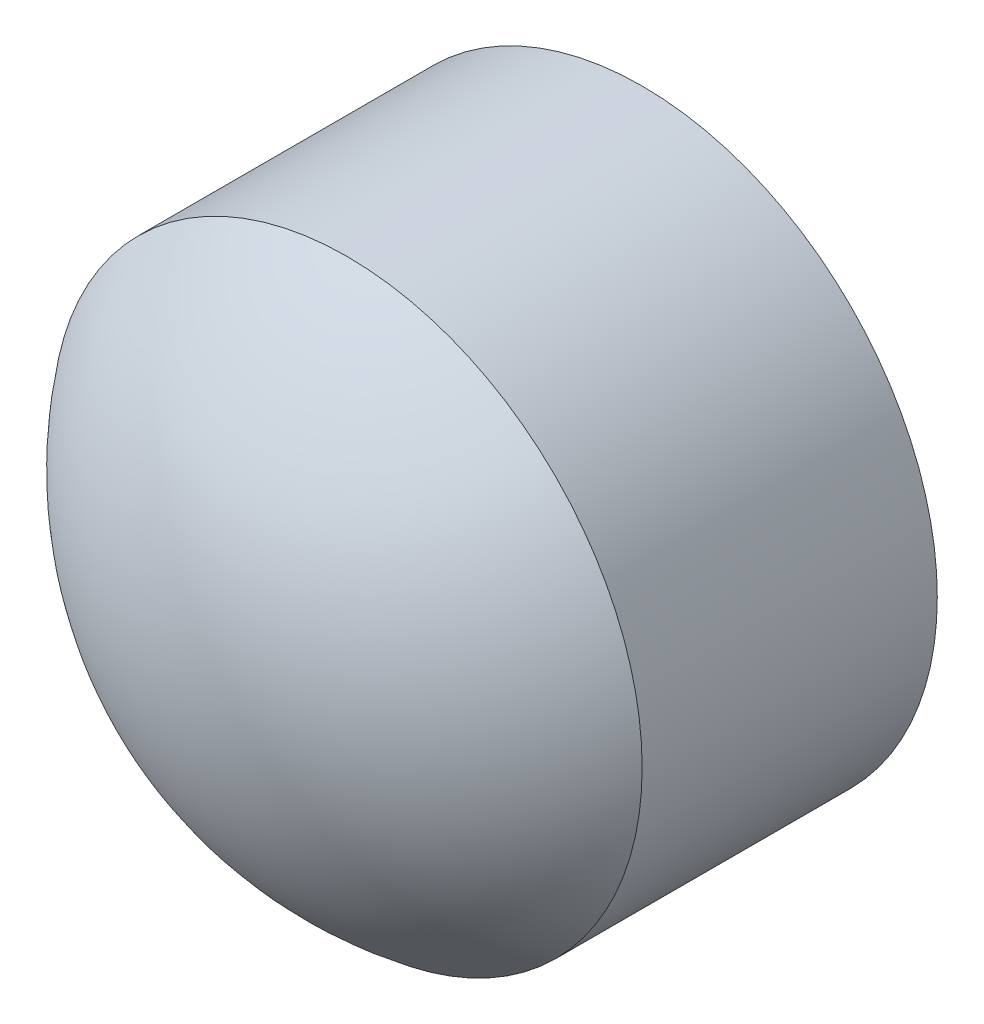
ISO-10303-21;
HEADER;
FILE_DESCRIPTION(('STEP AP214'),'2;1');
FILE_NAME('part.step','',(''),(''),'','','');
FILE_SCHEMA(('AUTOMOTIVE_DESIGN { 1 0 10303 214 1 1 1 1 }'));
ENDSEC;
DATA;
#1=APPLICATION_CONTEXT('core data for automotive mechanical design processes');
#2=APPLICATION_PROTOCOL_DEFINITION('international standard','automotive_design',2000,#1);
#3=PRODUCT_CONTEXT('',#1,'mechanical');
#4=PRODUCT('Part','Part','',(#3));
#5=PRODUCT_RELATED_PRODUCT_CATEGORY('part','',(#4));
#6=PRODUCT_DEFINITION_FORMATION('','',#4);
#7=PRODUCT_DEFINITION_CONTEXT('part definition',#1,'design');
#8=PRODUCT_DEFINITION('design','',#6,#7);
#9=PRODUCT_DEFINITION_SHAPE('','',#8);
#10=(LENGTH_UNIT() NAMED_UNIT(*) SI_UNIT(.MILLI.,.METRE.));
#11=(NAMED_UNIT(*) PLANE_ANGLE_UNIT() SI_UNIT($,.RADIAN.));
#12=(NAMED_UNIT(*) SI_UNIT($,.STERADIAN.) SOLID_ANGLE_UNIT());
#13=UNCERTAINTY_MEASURE_WITH_UNIT(LENGTH_MEASURE(1.E-05),#10,'distance_accuracy_value','');
#14=(GEOMETRIC_REPRESENTATION_CONTEXT(3) GLOBAL_UNCERTAINTY_ASSIGNED_CONTEXT((#13)) GLOBAL_UNIT_ASSIGNED_CONTEXT((#10,
#11,#12)) REPRESENTATION_CONTEXT('',''));
#15=CARTESIAN_POINT('',(0.,0.,0.));
#16=DIRECTION('',(0.,0.,1.));
#17=DIRECTION('',(1.,0.,0.));
#18=AXIS2_PLACEMENT_3D('',#15,#16,#17);
#19=CARTESIAN_POINT('',(0.,2.875,1.));
#20=DIRECTION('',(0.,0.,-1.));
#21=DIRECTION('',(-1.,0.,0.));
#22=AXIS2_PLACEMENT_3D('',#19,#20,#21);
#23=CYLINDRICAL_SURFACE('',#22,1.);
#24=CARTESIAN_POINT('',(0.,2.875,1.));
#25=DIRECTION('',(0.,0.,1.));
#26=DIRECTION('',(1.,0.,0.));
#27=AXIS2_PLACEMENT_3D('',#24,#25,#26);
#28=CIRCLE('',#27,1.);
#29=CARTESIAN_POINT('',(1.,2.875,1.));
#30=VERTEX_POINT('',#29);
#31=EDGE_CURVE('E10',#30,#30,#28,.T.);
#32=ORIENTED_EDGE('',*,*,#31,.F.);
#33=EDGE_LOOP('',(#32));
#34=FACE_BOUND('',#33,.T.);
#35=CARTESIAN_POINT('',(0.,2.875,0.));
#36=DIRECTION('',(0.,0.,1.));
#37=DIRECTION('',(1.,0.,0.));
#38=AXIS2_PLACEMENT_3D('',#35,#36,#37);
#39=CIRCLE('',#38,1.);
#40=CARTESIAN_POINT('',(1.,2.875,0.));
#41=VERTEX_POINT('',#40);
#42=EDGE_CURVE('E38',#41,#41,#39,.T.);
#43=ORIENTED_EDGE('',*,*,#42,.T.);
#44=EDGE_LOOP('',(#43));
#45=FACE_BOUND('',#44,.T.);
#46=ADVANCED_FACE('F31',(#34,#45),#23,.T.);
#47=CARTESIAN_POINT('',(0.,2.875,0.25));
#48=DIRECTION('',(0.,0.,1.));
#49=DIRECTION('',(1.,0.,0.));
#50=AXIS2_PLACEMENT_3D('',#47,#48,#49);
#51=SPHERICAL_SURFACE('',#50,1.25);
#52=ORIENTED_EDGE('',*,*,#31,.T.);
#53=EDGE_LOOP('',(#52));
#54=FACE_BOUND('',#53,.T.);
#55=ADVANCED_FACE('F33',(#54),#51,.T.);
#56=CARTESIAN_POINT('',(0.,2.875,0.));
#57=DIRECTION('',(0.,0.,1.));
#58=DIRECTION('',(1.,0.,0.));
#59=AXIS2_PLACEMENT_3D('',#56,#57,#58);
#60=PLANE('',#59);
#61=ORIENTED_EDGE('',*,*,#42,.F.);
#62=EDGE_LOOP('',(#61));
#63=FACE_BOUND('',#62,.T.);
#64=ADVANCED_FACE('F45',(#63),#60,.F.);
#65=CLOSED_SHELL('',(#46,#55,#64));
#66=MANIFOLD_SOLID_BREP('B2',#65);
#67=ADVANCED_BREP_SHAPE_REPRESENTATION('',(#18,#66),#14);
#68=SHAPE_DEFINITION_REPRESENTATION(#9,#67);
ENDSEC;
END-ISO-10303-21;
